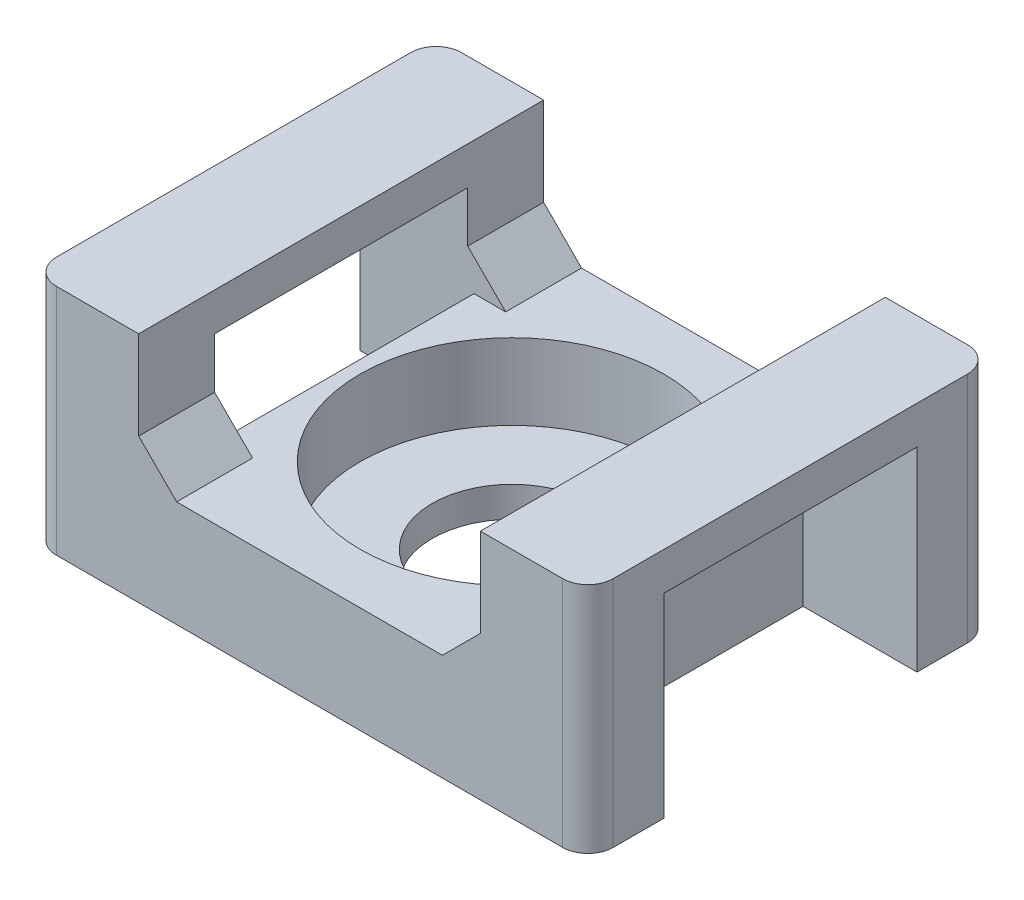
ISO-10303-21;
HEADER;
FILE_DESCRIPTION(('STEP AP214'),'2;1');
FILE_NAME('part.step','',(''),(''),'','','');
FILE_SCHEMA(('AUTOMOTIVE_DESIGN { 1 0 10303 214 1 1 1 1 }'));
ENDSEC;
DATA;
#1=APPLICATION_CONTEXT('core data for automotive mechanical design processes');
#2=APPLICATION_PROTOCOL_DEFINITION('international standard','automotive_design',2000,#1);
#3=PRODUCT_CONTEXT('',#1,'mechanical');
#4=PRODUCT('Part','Part','',(#3));
#5=PRODUCT_RELATED_PRODUCT_CATEGORY('part','',(#4));
#6=PRODUCT_DEFINITION_FORMATION('','',#4);
#7=PRODUCT_DEFINITION_CONTEXT('part definition',#1,'design');
#8=PRODUCT_DEFINITION('design','',#6,#7);
#9=PRODUCT_DEFINITION_SHAPE('','',#8);
#10=(LENGTH_UNIT() NAMED_UNIT(*) SI_UNIT(.MILLI.,.METRE.));
#11=(NAMED_UNIT(*) PLANE_ANGLE_UNIT() SI_UNIT($,.RADIAN.));
#12=(NAMED_UNIT(*) SI_UNIT($,.STERADIAN.) SOLID_ANGLE_UNIT());
#13=UNCERTAINTY_MEASURE_WITH_UNIT(LENGTH_MEASURE(1.E-05),#10,'distance_accuracy_value','');
#14=(GEOMETRIC_REPRESENTATION_CONTEXT(3) GLOBAL_UNCERTAINTY_ASSIGNED_CONTEXT((#13)) GLOBAL_UNIT_ASSIGNED_CONTEXT((#10,
#11,#12)) REPRESENTATION_CONTEXT('',''));
#15=CARTESIAN_POINT('',(0.,0.,0.));
#16=DIRECTION('',(0.,0.,1.));
#17=DIRECTION('',(1.,0.,0.));
#18=AXIS2_PLACEMENT_3D('',#15,#16,#17);
#19=CARTESIAN_POINT('',(-5.25,4.2,8.));
#20=DIRECTION('',(0.,-1.,0.));
#21=DIRECTION('',(1.,0.,0.));
#22=AXIS2_PLACEMENT_3D('',#19,#20,#21);
#23=PLANE('',#22);
#24=DIRECTION('',(-1.,0.,0.));
#25=VECTOR('',#24,1.);
#26=CARTESIAN_POINT('',(-5.25,4.2,-8.));
#27=LINE('',#26,#25);
#28=CARTESIAN_POINT('',(5.25,4.2,-8.));
#29=VERTEX_POINT('',#28);
#30=CARTESIAN_POINT('',(-5.25,4.2,-8.));
#31=VERTEX_POINT('',#30);
#32=EDGE_CURVE('E336',#29,#31,#27,.T.);
#33=ORIENTED_EDGE('',*,*,#32,.T.);
#34=DIRECTION('',(0.,0.,-1.));
#35=VECTOR('',#34,1.);
#36=CARTESIAN_POINT('',(-5.25,4.2,8.));
#37=LINE('',#36,#35);
#38=CARTESIAN_POINT('',(-5.25,4.2,-5.));
#39=VERTEX_POINT('',#38);
#40=EDGE_CURVE('E353',#39,#31,#37,.T.);
#41=ORIENTED_EDGE('',*,*,#40,.F.);
#42=DIRECTION('',(1.,0.,0.));
#43=VECTOR('',#42,1.);
#44=CARTESIAN_POINT('',(-5.25,4.2,-5.));
#45=LINE('',#44,#43);
#46=CARTESIAN_POINT('',(-6.5,4.2,-5.));
#47=VERTEX_POINT('',#46);
#48=EDGE_CURVE('E265',#47,#39,#45,.T.);
#49=ORIENTED_EDGE('',*,*,#48,.F.);
#50=DIRECTION('',(0.,0.,1.));
#51=VECTOR('',#50,1.);
#52=CARTESIAN_POINT('',(-6.5,4.2,-5.));
#53=LINE('',#52,#51);
#54=CARTESIAN_POINT('',(-6.5,4.2,5.));
#55=VERTEX_POINT('',#54);
#56=EDGE_CURVE('E303',#47,#55,#53,.T.);
#57=ORIENTED_EDGE('',*,*,#56,.T.);
#58=DIRECTION('',(1.,0.,0.));
#59=VECTOR('',#58,1.);
#60=CARTESIAN_POINT('',(-5.25,4.2,5.));
#61=LINE('',#60,#59);
#62=CARTESIAN_POINT('',(-5.25,4.2,5.));
#63=VERTEX_POINT('',#62);
#64=EDGE_CURVE('E285',#55,#63,#61,.T.);
#65=ORIENTED_EDGE('',*,*,#64,.T.);
#66=CARTESIAN_POINT('',(-5.25,4.2,8.));
#67=VERTEX_POINT('',#66);
#68=EDGE_CURVE('E354',#67,#63,#37,.T.);
#69=ORIENTED_EDGE('',*,*,#68,.F.);
#70=DIRECTION('',(-1.,0.,0.));
#71=VECTOR('',#70,1.);
#72=CARTESIAN_POINT('',(-5.25,4.2,8.));
#73=LINE('',#72,#71);
#74=CARTESIAN_POINT('',(5.25,4.2,8.));
#75=VERTEX_POINT('',#74);
#76=EDGE_CURVE('E317',#75,#67,#73,.T.);
#77=ORIENTED_EDGE('',*,*,#76,.F.);
#78=DIRECTION('',(0.,0.,-1.));
#79=VECTOR('',#78,1.);
#80=CARTESIAN_POINT('',(5.25,4.2,8.));
#81=LINE('',#80,#79);
#82=CARTESIAN_POINT('',(5.25,4.2,5.));
#83=VERTEX_POINT('',#82);
#84=EDGE_CURVE('E358',#75,#83,#81,.T.);
#85=ORIENTED_EDGE('',*,*,#84,.T.);
#86=DIRECTION('',(-1.,0.,0.));
#87=VECTOR('',#86,1.);
#88=CARTESIAN_POINT('',(5.25,4.2,5.));
#89=LINE('',#88,#87);
#90=CARTESIAN_POINT('',(6.5,4.2,5.));
#91=VERTEX_POINT('',#90);
#92=EDGE_CURVE('E534',#91,#83,#89,.T.);
#93=ORIENTED_EDGE('',*,*,#92,.F.);
#94=DIRECTION('',(0.,0.,1.));
#95=VECTOR('',#94,1.);
#96=CARTESIAN_POINT('',(6.5,4.2,-5.));
#97=LINE('',#96,#95);
#98=CARTESIAN_POINT('',(6.5,4.2,-5.));
#99=VERTEX_POINT('',#98);
#100=EDGE_CURVE('E250',#99,#91,#97,.T.);
#101=ORIENTED_EDGE('',*,*,#100,.F.);
#102=DIRECTION('',(-1.,0.,0.));
#103=VECTOR('',#102,1.);
#104=CARTESIAN_POINT('',(5.25,4.2,-5.));
#105=LINE('',#104,#103);
#106=CARTESIAN_POINT('',(5.25,4.2,-5.));
#107=VERTEX_POINT('',#106);
#108=EDGE_CURVE('E550',#99,#107,#105,.T.);
#109=ORIENTED_EDGE('',*,*,#108,.T.);
#110=EDGE_CURVE('E357',#107,#29,#81,.T.);
#111=ORIENTED_EDGE('',*,*,#110,.T.);
#112=EDGE_LOOP('',(#33,#41,#49,#57,#65,#69,#77,#85,#93,#101,#109,#111));
#113=FACE_BOUND('',#112,.T.);
#114=CARTESIAN_POINT('',(0.,4.2,0.));
#115=DIRECTION('',(0.,1.,0.));
#116=DIRECTION('',(0.,0.,1.));
#117=AXIS2_PLACEMENT_3D('',#114,#115,#116);
#118=CIRCLE('',#117,6.);
#119=CARTESIAN_POINT('',(0.,4.2,6.));
#120=VERTEX_POINT('',#119);
#121=EDGE_CURVE('E564',#120,#120,#118,.T.);
#122=ORIENTED_EDGE('',*,*,#121,.F.);
#123=EDGE_LOOP('',(#122));
#124=FACE_BOUND('',#123,.T.);
#125=ADVANCED_FACE('F35',(#113,#124),#23,.F.);
#126=CARTESIAN_POINT('',(6.75,5.70000000000001,8.));
#127=DIRECTION('',(0.707106781186549,-0.707106781186546,0.));
#128=DIRECTION('',(0.707106781186546,0.707106781186549,0.));
#129=AXIS2_PLACEMENT_3D('',#126,#127,#128);
#130=PLANE('',#129);
#131=DIRECTION('',(0.707106781186546,0.707106781186549,0.));
#132=VECTOR('',#131,1.);
#133=CARTESIAN_POINT('',(6.75,5.70000000000001,5.));
#134=LINE('',#133,#132);
#135=CARTESIAN_POINT('',(6.75,5.70000000000001,5.));
#136=VERTEX_POINT('',#135);
#137=EDGE_CURVE('E440',#83,#136,#134,.T.);
#138=ORIENTED_EDGE('',*,*,#137,.F.);
#139=ORIENTED_EDGE('',*,*,#84,.F.);
#140=DIRECTION('',(-0.707106781186546,-0.707106781186549,0.));
#141=VECTOR('',#140,1.);
#142=CARTESIAN_POINT('',(6.75,5.70000000000001,8.));
#143=LINE('',#142,#141);
#144=CARTESIAN_POINT('',(6.75,5.70000000000001,8.));
#145=VERTEX_POINT('',#144);
#146=EDGE_CURVE('E315',#145,#75,#143,.T.);
#147=ORIENTED_EDGE('',*,*,#146,.F.);
#148=DIRECTION('',(0.,0.,-1.));
#149=VECTOR('',#148,1.);
#150=CARTESIAN_POINT('',(6.75,5.70000000000001,8.));
#151=LINE('',#150,#149);
#152=EDGE_CURVE('E362',#145,#136,#151,.T.);
#153=ORIENTED_EDGE('',*,*,#152,.T.);
#154=EDGE_LOOP('',(#138,#139,#147,#153));
#155=FACE_BOUND('',#154,.T.);
#156=ADVANCED_FACE('F439',(#155),#130,.F.);
#157=CARTESIAN_POINT('',(-6.75,5.70000000000001,8.));
#158=DIRECTION('',(-0.707106781186549,-0.707106781186546,0.));
#159=DIRECTION('',(0.707106781186546,-0.707106781186549,0.));
#160=AXIS2_PLACEMENT_3D('',#157,#158,#159);
#161=PLANE('',#160);
#162=DIRECTION('',(-0.707106781186546,0.707106781186549,0.));
#163=VECTOR('',#162,1.);
#164=CARTESIAN_POINT('',(-6.75,5.70000000000001,5.));
#165=LINE('',#164,#163);
#166=CARTESIAN_POINT('',(-6.75,5.70000000000001,5.));
#167=VERTEX_POINT('',#166);
#168=EDGE_CURVE('E288',#63,#167,#165,.T.);
#169=ORIENTED_EDGE('',*,*,#168,.T.);
#170=DIRECTION('',(0.,0.,-1.));
#171=VECTOR('',#170,1.);
#172=CARTESIAN_POINT('',(-6.75,5.70000000000001,8.));
#173=LINE('',#172,#171);
#174=CARTESIAN_POINT('',(-6.75,5.70000000000001,8.));
#175=VERTEX_POINT('',#174);
#176=EDGE_CURVE('E350',#175,#167,#173,.T.);
#177=ORIENTED_EDGE('',*,*,#176,.F.);
#178=DIRECTION('',(-0.707106781186546,0.707106781186549,0.));
#179=VECTOR('',#178,1.);
#180=CARTESIAN_POINT('',(-6.75,5.70000000000001,8.));
#181=LINE('',#180,#179);
#182=EDGE_CURVE('E319',#67,#175,#181,.T.);
#183=ORIENTED_EDGE('',*,*,#182,.F.);
#184=ORIENTED_EDGE('',*,*,#68,.T.);
#185=EDGE_LOOP('',(#169,#177,#183,#184));
#186=FACE_BOUND('',#185,.T.);
#187=ADVANCED_FACE('F448',(#186),#161,.F.);
#188=CARTESIAN_POINT('',(-11.,0.,8.));
#189=DIRECTION('',(1.,0.,0.));
#190=DIRECTION('',(0.,0.,-1.));
#191=AXIS2_PLACEMENT_3D('',#188,#189,#190);
#192=PLANE('',#191);
#193=DIRECTION('',(0.,0.,-1.));
#194=VECTOR('',#193,1.);
#195=CARTESIAN_POINT('',(-11.,9.2,8.));
#196=LINE('',#195,#194);
#197=CARTESIAN_POINT('',(-11.,9.2,7.));
#198=VERTEX_POINT('',#197);
#199=CARTESIAN_POINT('',(-11.,9.2,-7.));
#200=VERTEX_POINT('',#199);
#201=EDGE_CURVE('E325',#198,#200,#196,.T.);
#202=ORIENTED_EDGE('',*,*,#201,.T.);
#203=DIRECTION('',(0.,-1.,0.));
#204=VECTOR('',#203,1.);
#205=CARTESIAN_POINT('',(-11.,0.,-7.));
#206=LINE('',#205,#204);
#207=CARTESIAN_POINT('',(-11.,0.,-7.));
#208=VERTEX_POINT('',#207);
#209=EDGE_CURVE('E400',#200,#208,#206,.T.);
#210=ORIENTED_EDGE('',*,*,#209,.T.);
#211=DIRECTION('',(0.,0.,-1.));
#212=VECTOR('',#211,1.);
#213=CARTESIAN_POINT('',(-11.,0.,8.));
#214=LINE('',#213,#212);
#215=CARTESIAN_POINT('',(-11.,0.,-5.));
#216=VERTEX_POINT('',#215);
#217=EDGE_CURVE('E374',#216,#208,#214,.T.);
#218=ORIENTED_EDGE('',*,*,#217,.F.);
#219=DIRECTION('',(0.,-1.,0.));
#220=VECTOR('',#219,1.);
#221=CARTESIAN_POINT('',(-11.,0.,-5.));
#222=LINE('',#221,#220);
#223=CARTESIAN_POINT('',(-11.,7.7,-5.));
#224=VERTEX_POINT('',#223);
#225=EDGE_CURVE('E256',#224,#216,#222,.T.);
#226=ORIENTED_EDGE('',*,*,#225,.F.);
#227=DIRECTION('',(0.,0.,1.));
#228=VECTOR('',#227,1.);
#229=CARTESIAN_POINT('',(-11.,7.7,-5.));
#230=LINE('',#229,#228);
#231=CARTESIAN_POINT('',(-11.,7.7,5.));
#232=VERTEX_POINT('',#231);
#233=EDGE_CURVE('E296',#224,#232,#230,.T.);
#234=ORIENTED_EDGE('',*,*,#233,.T.);
#235=DIRECTION('',(0.,-1.,0.));
#236=VECTOR('',#235,1.);
#237=CARTESIAN_POINT('',(-11.,0.,5.));
#238=LINE('',#237,#236);
#239=CARTESIAN_POINT('',(-11.,0.,5.));
#240=VERTEX_POINT('',#239);
#241=EDGE_CURVE('E275',#232,#240,#238,.T.);
#242=ORIENTED_EDGE('',*,*,#241,.T.);
#243=CARTESIAN_POINT('',(-11.,0.,7.));
#244=VERTEX_POINT('',#243);
#245=EDGE_CURVE('E375',#244,#240,#214,.T.);
#246=ORIENTED_EDGE('',*,*,#245,.F.);
#247=DIRECTION('',(0.,-1.,0.));
#248=VECTOR('',#247,1.);
#249=CARTESIAN_POINT('',(-11.,0.,7.));
#250=LINE('',#249,#248);
#251=EDGE_CURVE('E398',#244,#198,#250,.F.);
#252=ORIENTED_EDGE('',*,*,#251,.T.);
#253=EDGE_LOOP('',(#202,#210,#218,#226,#234,#242,#246,#252));
#254=FACE_BOUND('',#253,.T.);
#255=ADVANCED_FACE('F487',(#254),#192,.F.);
#256=CARTESIAN_POINT('',(11.,0.,8.));
#257=DIRECTION('',(0.,1.,0.));
#258=DIRECTION('',(0.,0.,1.));
#259=AXIS2_PLACEMENT_3D('',#256,#257,#258);
#260=PLANE('',#259);
#261=CARTESIAN_POINT('',(0.,0.,0.));
#262=DIRECTION('',(0.,1.,0.));
#263=DIRECTION('',(0.,0.,1.));
#264=AXIS2_PLACEMENT_3D('',#261,#262,#263);
#265=CIRCLE('',#264,3.15);
#266=CARTESIAN_POINT('',(0.,0.,3.15));
#267=VERTEX_POINT('',#266);
#268=EDGE_CURVE('E529',#267,#267,#265,.T.);
#269=ORIENTED_EDGE('',*,*,#268,.T.);
#270=EDGE_LOOP('',(#269));
#271=FACE_BOUND('',#270,.T.);
#272=DIRECTION('',(1.,0.,0.));
#273=VECTOR('',#272,1.);
#274=CARTESIAN_POINT('',(11.,0.,-8.));
#275=LINE('',#274,#273);
#276=CARTESIAN_POINT('',(-10.,0.,-8.));
#277=VERTEX_POINT('',#276);
#278=CARTESIAN_POINT('',(10.,0.,-8.));
#279=VERTEX_POINT('',#278);
#280=EDGE_CURVE('E299',#277,#279,#275,.T.);
#281=ORIENTED_EDGE('',*,*,#280,.T.);
#282=CARTESIAN_POINT('',(10.,0.,-7.));
#283=DIRECTION('',(0.,1.,0.));
#284=DIRECTION('',(0.,0.,1.));
#285=AXIS2_PLACEMENT_3D('',#282,#283,#284);
#286=CIRCLE('',#285,1.);
#287=CARTESIAN_POINT('',(11.,0.,-7.));
#288=VERTEX_POINT('',#287);
#289=EDGE_CURVE('E396',#279,#288,#286,.F.);
#290=ORIENTED_EDGE('',*,*,#289,.T.);
#291=DIRECTION('',(0.,0.,-1.));
#292=VECTOR('',#291,1.);
#293=CARTESIAN_POINT('',(11.,0.,8.));
#294=LINE('',#293,#292);
#295=CARTESIAN_POINT('',(11.,0.,-5.));
#296=VERTEX_POINT('',#295);
#297=EDGE_CURVE('E371',#296,#288,#294,.T.);
#298=ORIENTED_EDGE('',*,*,#297,.F.);
#299=DIRECTION('',(-1.,0.,0.));
#300=VECTOR('',#299,1.);
#301=CARTESIAN_POINT('',(6.5,0.,-5.));
#302=LINE('',#301,#300);
#303=CARTESIAN_POINT('',(6.5,0.,-5.));
#304=VERTEX_POINT('',#303);
#305=EDGE_CURVE('E239',#296,#304,#302,.T.);
#306=ORIENTED_EDGE('',*,*,#305,.T.);
#307=DIRECTION('',(0.,0.,1.));
#308=VECTOR('',#307,1.);
#309=CARTESIAN_POINT('',(6.5,0.,-5.));
#310=LINE('',#309,#308);
#311=CARTESIAN_POINT('',(6.5,0.,5.));
#312=VERTEX_POINT('',#311);
#313=EDGE_CURVE('E279',#304,#312,#310,.T.);
#314=ORIENTED_EDGE('',*,*,#313,.T.);
#315=DIRECTION('',(-1.,0.,0.));
#316=VECTOR('',#315,1.);
#317=CARTESIAN_POINT('',(6.5,0.,5.));
#318=LINE('',#317,#316);
#319=CARTESIAN_POINT('',(11.,0.,5.));
#320=VERTEX_POINT('',#319);
#321=EDGE_CURVE('E243',#320,#312,#318,.T.);
#322=ORIENTED_EDGE('',*,*,#321,.F.);
#323=CARTESIAN_POINT('',(11.,0.,7.));
#324=VERTEX_POINT('',#323);
#325=EDGE_CURVE('E372',#324,#320,#294,.T.);
#326=ORIENTED_EDGE('',*,*,#325,.F.);
#327=CARTESIAN_POINT('',(10.,0.,7.));
#328=DIRECTION('',(0.,1.,0.));
#329=DIRECTION('',(0.,0.,1.));
#330=AXIS2_PLACEMENT_3D('',#327,#328,#329);
#331=CIRCLE('',#330,1.);
#332=CARTESIAN_POINT('',(10.,0.,8.));
#333=VERTEX_POINT('',#332);
#334=EDGE_CURVE('E392',#324,#333,#331,.F.);
#335=ORIENTED_EDGE('',*,*,#334,.T.);
#336=DIRECTION('',(1.,0.,0.));
#337=VECTOR('',#336,1.);
#338=CARTESIAN_POINT('',(11.,0.,8.));
#339=LINE('',#338,#337);
#340=CARTESIAN_POINT('',(-10.,0.,8.));
#341=VERTEX_POINT('',#340);
#342=EDGE_CURVE('E307',#341,#333,#339,.T.);
#343=ORIENTED_EDGE('',*,*,#342,.F.);
#344=CARTESIAN_POINT('',(-10.,0.,7.));
#345=DIRECTION('',(0.,1.,0.));
#346=DIRECTION('',(0.,0.,1.));
#347=AXIS2_PLACEMENT_3D('',#344,#345,#346);
#348=CIRCLE('',#347,1.);
#349=EDGE_CURVE('E390',#341,#244,#348,.F.);
#350=ORIENTED_EDGE('',*,*,#349,.T.);
#351=ORIENTED_EDGE('',*,*,#245,.T.);
#352=DIRECTION('',(1.,0.,0.));
#353=VECTOR('',#352,1.);
#354=CARTESIAN_POINT('',(-6.5,0.,5.));
#355=LINE('',#354,#353);
#356=CARTESIAN_POINT('',(-6.5,0.,5.));
#357=VERTEX_POINT('',#356);
#358=EDGE_CURVE('E278',#240,#357,#355,.T.);
#359=ORIENTED_EDGE('',*,*,#358,.T.);
#360=DIRECTION('',(0.,0.,1.));
#361=VECTOR('',#360,1.);
#362=CARTESIAN_POINT('',(-6.5,0.,-5.));
#363=LINE('',#362,#361);
#364=CARTESIAN_POINT('',(-6.5,0.,-5.));
#365=VERTEX_POINT('',#364);
#366=EDGE_CURVE('E274',#365,#357,#363,.T.);
#367=ORIENTED_EDGE('',*,*,#366,.F.);
#368=DIRECTION('',(1.,0.,0.));
#369=VECTOR('',#368,1.);
#370=CARTESIAN_POINT('',(-6.5,0.,-5.));
#371=LINE('',#370,#369);
#372=EDGE_CURVE('E258',#216,#365,#371,.T.);
#373=ORIENTED_EDGE('',*,*,#372,.F.);
#374=ORIENTED_EDGE('',*,*,#217,.T.);
#375=CARTESIAN_POINT('',(-10.,0.,-7.));
#376=DIRECTION('',(0.,1.,0.));
#377=DIRECTION('',(0.,0.,1.));
#378=AXIS2_PLACEMENT_3D('',#375,#376,#377);
#379=CIRCLE('',#378,1.);
#380=EDGE_CURVE('E394',#208,#277,#379,.F.);
#381=ORIENTED_EDGE('',*,*,#380,.T.);
#382=EDGE_LOOP('',(#281,#290,#298,#306,#314,#322,#326,#335,#343,#350,#351,#359,#367,#373,#374,#381));
#383=FACE_BOUND('',#382,.T.);
#384=ADVANCED_FACE('F412',(#271,#383),#260,.F.);
#385=CARTESIAN_POINT('',(11.,0.,8.));
#386=DIRECTION('',(-1.,0.,0.));
#387=DIRECTION('',(0.,0.,1.));
#388=AXIS2_PLACEMENT_3D('',#385,#386,#387);
#389=PLANE('',#388);
#390=ORIENTED_EDGE('',*,*,#297,.T.);
#391=DIRECTION('',(0.,1.,0.));
#392=VECTOR('',#391,1.);
#393=CARTESIAN_POINT('',(11.,9.2,-7.));
#394=LINE('',#393,#392);
#395=CARTESIAN_POINT('',(11.,9.2,-7.));
#396=VERTEX_POINT('',#395);
#397=EDGE_CURVE('E379',#288,#396,#394,.T.);
#398=ORIENTED_EDGE('',*,*,#397,.T.);
#399=DIRECTION('',(0.,0.,-1.));
#400=VECTOR('',#399,1.);
#401=CARTESIAN_POINT('',(11.,9.2,8.));
#402=LINE('',#401,#400);
#403=CARTESIAN_POINT('',(11.,9.2,7.));
#404=VERTEX_POINT('',#403);
#405=EDGE_CURVE('E368',#404,#396,#402,.T.);
#406=ORIENTED_EDGE('',*,*,#405,.F.);
#407=DIRECTION('',(0.,1.,0.));
#408=VECTOR('',#407,1.);
#409=CARTESIAN_POINT('',(11.,0.,7.));
#410=LINE('',#409,#408);
#411=EDGE_CURVE('E377',#404,#324,#410,.F.);
#412=ORIENTED_EDGE('',*,*,#411,.T.);
#413=ORIENTED_EDGE('',*,*,#325,.T.);
#414=DIRECTION('',(0.,-1.,0.));
#415=VECTOR('',#414,1.);
#416=CARTESIAN_POINT('',(11.,0.,5.));
#417=LINE('',#416,#415);
#418=CARTESIAN_POINT('',(11.,7.7,5.));
#419=VERTEX_POINT('',#418);
#420=EDGE_CURVE('E248',#419,#320,#417,.T.);
#421=ORIENTED_EDGE('',*,*,#420,.F.);
#422=DIRECTION('',(0.,0.,1.));
#423=VECTOR('',#422,1.);
#424=CARTESIAN_POINT('',(11.,7.7,-5.));
#425=LINE('',#424,#423);
#426=CARTESIAN_POINT('',(11.,7.7,-5.));
#427=VERTEX_POINT('',#426);
#428=EDGE_CURVE('E226',#427,#419,#425,.T.);
#429=ORIENTED_EDGE('',*,*,#428,.F.);
#430=DIRECTION('',(0.,-1.,0.));
#431=VECTOR('',#430,1.);
#432=CARTESIAN_POINT('',(11.,0.,-5.));
#433=LINE('',#432,#431);
#434=EDGE_CURVE('E233',#427,#296,#433,.T.);
#435=ORIENTED_EDGE('',*,*,#434,.T.);
#436=EDGE_LOOP('',(#390,#398,#406,#412,#413,#421,#429,#435));
#437=FACE_BOUND('',#436,.T.);
#438=ADVANCED_FACE('F246',(#437),#389,.F.);
#439=CARTESIAN_POINT('',(11.,9.2,8.));
#440=DIRECTION('',(0.,-1.,0.));
#441=DIRECTION('',(1.,0.,0.));
#442=AXIS2_PLACEMENT_3D('',#439,#440,#441);
#443=PLANE('',#442);
#444=ORIENTED_EDGE('',*,*,#405,.T.);
#445=CARTESIAN_POINT('',(10.,9.2,-7.));
#446=DIRECTION('',(0.,-1.,0.));
#447=DIRECTION('',(1.,0.,0.));
#448=AXIS2_PLACEMENT_3D('',#445,#446,#447);
#449=CIRCLE('',#448,1.);
#450=CARTESIAN_POINT('',(10.,9.2,-8.));
#451=VERTEX_POINT('',#450);
#452=EDGE_CURVE('E384',#396,#451,#449,.F.);
#453=ORIENTED_EDGE('',*,*,#452,.T.);
#454=DIRECTION('',(-1.,0.,0.));
#455=VECTOR('',#454,1.);
#456=CARTESIAN_POINT('',(11.,9.2,-8.));
#457=LINE('',#456,#455);
#458=CARTESIAN_POINT('',(6.75,9.2,-8.));
#459=VERTEX_POINT('',#458);
#460=EDGE_CURVE('E328',#451,#459,#457,.T.);
#461=ORIENTED_EDGE('',*,*,#460,.T.);
#462=DIRECTION('',(0.,0.,-1.));
#463=VECTOR('',#462,1.);
#464=CARTESIAN_POINT('',(6.75,9.2,8.));
#465=LINE('',#464,#463);
#466=CARTESIAN_POINT('',(6.75,9.2,8.));
#467=VERTEX_POINT('',#466);
#468=EDGE_CURVE('E365',#467,#459,#465,.T.);
#469=ORIENTED_EDGE('',*,*,#468,.F.);
#470=DIRECTION('',(-1.,0.,0.));
#471=VECTOR('',#470,1.);
#472=CARTESIAN_POINT('',(11.,9.2,8.));
#473=LINE('',#472,#471);
#474=CARTESIAN_POINT('',(10.,9.2,8.));
#475=VERTEX_POINT('',#474);
#476=EDGE_CURVE('E310',#475,#467,#473,.T.);
#477=ORIENTED_EDGE('',*,*,#476,.F.);
#478=CARTESIAN_POINT('',(10.,9.2,7.));
#479=DIRECTION('',(0.,-1.,0.));
#480=DIRECTION('',(1.,0.,0.));
#481=AXIS2_PLACEMENT_3D('',#478,#479,#480);
#482=CIRCLE('',#481,1.);
#483=EDGE_CURVE('E382',#475,#404,#482,.F.);
#484=ORIENTED_EDGE('',*,*,#483,.T.);
#485=EDGE_LOOP('',(#444,#453,#461,#469,#477,#484));
#486=FACE_BOUND('',#485,.T.);
#487=ADVANCED_FACE('F423',(#486),#443,.F.);
#488=CARTESIAN_POINT('',(6.75,9.2,8.));
#489=DIRECTION('',(1.,0.,0.));
#490=DIRECTION('',(0.,1.,0.));
#491=AXIS2_PLACEMENT_3D('',#488,#489,#490);
#492=PLANE('',#491);
#493=CARTESIAN_POINT('',(6.75,5.70000000000001,-5.));
#494=VERTEX_POINT('',#493);
#495=CARTESIAN_POINT('',(6.75,5.70000000000001,-8.));
#496=VERTEX_POINT('',#495);
#497=EDGE_CURVE('E361',#494,#496,#151,.T.);
#498=ORIENTED_EDGE('',*,*,#497,.F.);
#499=DIRECTION('',(0.,1.,0.));
#500=VECTOR('',#499,1.);
#501=CARTESIAN_POINT('',(6.75,7.7,-5.));
#502=LINE('',#501,#500);
#503=CARTESIAN_POINT('',(6.75,7.7,-5.));
#504=VERTEX_POINT('',#503);
#505=EDGE_CURVE('E232',#494,#504,#502,.T.);
#506=ORIENTED_EDGE('',*,*,#505,.T.);
#507=DIRECTION('',(0.,0.,1.));
#508=VECTOR('',#507,1.);
#509=CARTESIAN_POINT('',(6.75,7.7,-5.));
#510=LINE('',#509,#508);
#511=CARTESIAN_POINT('',(6.75,7.7,5.));
#512=VERTEX_POINT('',#511);
#513=EDGE_CURVE('E229',#504,#512,#510,.T.);
#514=ORIENTED_EDGE('',*,*,#513,.T.);
#515=DIRECTION('',(0.,1.,0.));
#516=VECTOR('',#515,1.);
#517=CARTESIAN_POINT('',(6.75,7.7,5.));
#518=LINE('',#517,#516);
#519=EDGE_CURVE('E544',#136,#512,#518,.T.);
#520=ORIENTED_EDGE('',*,*,#519,.F.);
#521=ORIENTED_EDGE('',*,*,#152,.F.);
#522=DIRECTION('',(0.,-1.,0.));
#523=VECTOR('',#522,1.);
#524=CARTESIAN_POINT('',(6.75,9.2,8.));
#525=LINE('',#524,#523);
#526=EDGE_CURVE('E313',#467,#145,#525,.T.);
#527=ORIENTED_EDGE('',*,*,#526,.F.);
#528=ORIENTED_EDGE('',*,*,#468,.T.);
#529=DIRECTION('',(0.,-1.,0.));
#530=VECTOR('',#529,1.);
#531=CARTESIAN_POINT('',(6.75,9.2,-8.));
#532=LINE('',#531,#530);
#533=EDGE_CURVE('E330',#459,#496,#532,.T.);
#534=ORIENTED_EDGE('',*,*,#533,.T.);
#535=EDGE_LOOP('',(#498,#506,#514,#520,#521,#527,#528,#534));
#536=FACE_BOUND('',#535,.T.);
#537=ADVANCED_FACE('F431',(#536),#492,.F.);
#538=ORIENTED_EDGE('',*,*,#110,.F.);
#539=DIRECTION('',(0.707106781186546,0.707106781186549,0.));
#540=VECTOR('',#539,1.);
#541=CARTESIAN_POINT('',(6.75,5.70000000000001,-5.));
#542=LINE('',#541,#540);
#543=EDGE_CURVE('E552',#107,#494,#542,.T.);
#544=ORIENTED_EDGE('',*,*,#543,.T.);
#545=ORIENTED_EDGE('',*,*,#497,.T.);
#546=DIRECTION('',(-0.707106781186546,-0.707106781186549,0.));
#547=VECTOR('',#546,1.);
#548=CARTESIAN_POINT('',(6.75,5.70000000000001,-8.));
#549=LINE('',#548,#547);
#550=EDGE_CURVE('E333',#496,#29,#549,.T.);
#551=ORIENTED_EDGE('',*,*,#550,.T.);
#552=EDGE_LOOP('',(#538,#544,#545,#551));
#553=FACE_BOUND('',#552,.T.);
#554=ADVANCED_FACE('F474',(#553),#130,.F.);
#555=CARTESIAN_POINT('',(-6.75,5.70000000000001,-5.));
#556=VERTEX_POINT('',#555);
#557=CARTESIAN_POINT('',(-6.75,5.70000000000001,-8.));
#558=VERTEX_POINT('',#557);
#559=EDGE_CURVE('E349',#556,#558,#173,.T.);
#560=ORIENTED_EDGE('',*,*,#559,.F.);
#561=DIRECTION('',(-0.707106781186546,0.707106781186549,0.));
#562=VECTOR('',#561,1.);
#563=CARTESIAN_POINT('',(-6.75,5.70000000000001,-5.));
#564=LINE('',#563,#562);
#565=EDGE_CURVE('E267',#39,#556,#564,.T.);
#566=ORIENTED_EDGE('',*,*,#565,.F.);
#567=ORIENTED_EDGE('',*,*,#40,.T.);
#568=DIRECTION('',(-0.707106781186546,0.707106781186549,0.));
#569=VECTOR('',#568,1.);
#570=CARTESIAN_POINT('',(-6.75,5.70000000000001,-8.));
#571=LINE('',#570,#569);
#572=EDGE_CURVE('E339',#31,#558,#571,.T.);
#573=ORIENTED_EDGE('',*,*,#572,.T.);
#574=EDGE_LOOP('',(#560,#566,#567,#573));
#575=FACE_BOUND('',#574,.T.);
#576=ADVANCED_FACE('F465',(#575),#161,.F.);
#577=CARTESIAN_POINT('',(-6.75,9.2,8.));
#578=DIRECTION('',(-1.,0.,0.));
#579=DIRECTION('',(0.,0.,1.));
#580=AXIS2_PLACEMENT_3D('',#577,#578,#579);
#581=PLANE('',#580);
#582=DIRECTION('',(0.,0.,1.));
#583=VECTOR('',#582,1.);
#584=CARTESIAN_POINT('',(-6.75,7.7,-5.));
#585=LINE('',#584,#583);
#586=CARTESIAN_POINT('',(-6.75,7.7,-5.));
#587=VERTEX_POINT('',#586);
#588=CARTESIAN_POINT('',(-6.75,7.7,5.));
#589=VERTEX_POINT('',#588);
#590=EDGE_CURVE('E300',#587,#589,#585,.T.);
#591=ORIENTED_EDGE('',*,*,#590,.F.);
#592=DIRECTION('',(0.,1.,0.));
#593=VECTOR('',#592,1.);
#594=CARTESIAN_POINT('',(-6.75,7.7,-5.));
#595=LINE('',#594,#593);
#596=EDGE_CURVE('E269',#556,#587,#595,.T.);
#597=ORIENTED_EDGE('',*,*,#596,.F.);
#598=ORIENTED_EDGE('',*,*,#559,.T.);
#599=DIRECTION('',(0.,1.,0.));
#600=VECTOR('',#599,1.);
#601=CARTESIAN_POINT('',(-6.75,9.2,-8.));
#602=LINE('',#601,#600);
#603=CARTESIAN_POINT('',(-6.75,9.2,-8.));
#604=VERTEX_POINT('',#603);
#605=EDGE_CURVE('E342',#558,#604,#602,.T.);
#606=ORIENTED_EDGE('',*,*,#605,.T.);
#607=DIRECTION('',(0.,0.,-1.));
#608=VECTOR('',#607,1.);
#609=CARTESIAN_POINT('',(-6.75,9.2,8.));
#610=LINE('',#609,#608);
#611=CARTESIAN_POINT('',(-6.75,9.2,8.));
#612=VERTEX_POINT('',#611);
#613=EDGE_CURVE('E346',#612,#604,#610,.T.);
#614=ORIENTED_EDGE('',*,*,#613,.F.);
#615=DIRECTION('',(0.,1.,0.));
#616=VECTOR('',#615,1.);
#617=CARTESIAN_POINT('',(-6.75,9.2,8.));
#618=LINE('',#617,#616);
#619=EDGE_CURVE('E321',#175,#612,#618,.T.);
#620=ORIENTED_EDGE('',*,*,#619,.F.);
#621=ORIENTED_EDGE('',*,*,#176,.T.);
#622=DIRECTION('',(0.,1.,0.));
#623=VECTOR('',#622,1.);
#624=CARTESIAN_POINT('',(-6.75,7.7,5.));
#625=LINE('',#624,#623);
#626=EDGE_CURVE('E291',#167,#589,#625,.T.);
#627=ORIENTED_EDGE('',*,*,#626,.T.);
#628=EDGE_LOOP('',(#591,#597,#598,#606,#614,#620,#621,#627));
#629=FACE_BOUND('',#628,.T.);
#630=ADVANCED_FACE('F453',(#629),#581,.F.);
#631=CARTESIAN_POINT('',(-11.,9.2,8.));
#632=DIRECTION('',(0.,-1.,0.));
#633=DIRECTION('',(0.,0.,-1.));
#634=AXIS2_PLACEMENT_3D('',#631,#632,#633);
#635=PLANE('',#634);
#636=DIRECTION('',(-1.,0.,0.));
#637=VECTOR('',#636,1.);
#638=CARTESIAN_POINT('',(-11.,9.2,-8.));
#639=LINE('',#638,#637);
#640=CARTESIAN_POINT('',(-10.,9.2,-8.));
#641=VERTEX_POINT('',#640);
#642=EDGE_CURVE('E311',#604,#641,#639,.T.);
#643=ORIENTED_EDGE('',*,*,#642,.T.);
#644=CARTESIAN_POINT('',(-10.,9.2,-7.));
#645=DIRECTION('',(0.,-1.,0.));
#646=DIRECTION('',(0.,0.,-1.));
#647=AXIS2_PLACEMENT_3D('',#644,#645,#646);
#648=CIRCLE('',#647,1.);
#649=EDGE_CURVE('E56',#641,#200,#648,.F.);
#650=ORIENTED_EDGE('',*,*,#649,.T.);
#651=ORIENTED_EDGE('',*,*,#201,.F.);
#652=CARTESIAN_POINT('',(-10.,9.2,7.));
#653=DIRECTION('',(0.,-1.,0.));
#654=DIRECTION('',(0.,0.,-1.));
#655=AXIS2_PLACEMENT_3D('',#652,#653,#654);
#656=CIRCLE('',#655,1.);
#657=CARTESIAN_POINT('',(-10.,9.2,8.));
#658=VERTEX_POINT('',#657);
#659=EDGE_CURVE('E50',#198,#658,#656,.F.);
#660=ORIENTED_EDGE('',*,*,#659,.T.);
#661=DIRECTION('',(-1.,0.,0.));
#662=VECTOR('',#661,1.);
#663=CARTESIAN_POINT('',(-11.,9.2,8.));
#664=LINE('',#663,#662);
#665=EDGE_CURVE('E323',#612,#658,#664,.T.);
#666=ORIENTED_EDGE('',*,*,#665,.F.);
#667=ORIENTED_EDGE('',*,*,#613,.T.);
#668=EDGE_LOOP('',(#643,#650,#651,#660,#666,#667));
#669=FACE_BOUND('',#668,.T.);
#670=ADVANCED_FACE('F456',(#669),#635,.F.);
#671=CARTESIAN_POINT('',(0.,0.,8.));
#672=DIRECTION('',(0.,0.,-1.));
#673=DIRECTION('',(-1.,0.,0.));
#674=AXIS2_PLACEMENT_3D('',#671,#672,#673);
#675=PLANE('',#674);
#676=ORIENTED_EDGE('',*,*,#342,.T.);
#677=DIRECTION('',(0.,1.,0.));
#678=VECTOR('',#677,1.);
#679=CARTESIAN_POINT('',(10.,0.,8.));
#680=LINE('',#679,#678);
#681=EDGE_CURVE('E11',#333,#475,#680,.T.);
#682=ORIENTED_EDGE('',*,*,#681,.T.);
#683=ORIENTED_EDGE('',*,*,#476,.T.);
#684=ORIENTED_EDGE('',*,*,#526,.T.);
#685=ORIENTED_EDGE('',*,*,#146,.T.);
#686=ORIENTED_EDGE('',*,*,#76,.T.);
#687=ORIENTED_EDGE('',*,*,#182,.T.);
#688=ORIENTED_EDGE('',*,*,#619,.T.);
#689=ORIENTED_EDGE('',*,*,#665,.T.);
#690=DIRECTION('',(0.,-1.,0.));
#691=VECTOR('',#690,1.);
#692=CARTESIAN_POINT('',(-10.,0.,8.));
#693=LINE('',#692,#691);
#694=EDGE_CURVE('E43',#658,#341,#693,.T.);
#695=ORIENTED_EDGE('',*,*,#694,.T.);
#696=EDGE_LOOP('',(#676,#682,#683,#684,#685,#686,#687,#688,#689,#695));
#697=FACE_BOUND('',#696,.T.);
#698=ADVANCED_FACE('F408',(#697),#675,.F.);
#699=CARTESIAN_POINT('',(0.,0.,-8.));
#700=DIRECTION('',(0.,0.,-1.));
#701=DIRECTION('',(-1.,0.,0.));
#702=AXIS2_PLACEMENT_3D('',#699,#700,#701);
#703=PLANE('',#702);
#704=ORIENTED_EDGE('',*,*,#460,.F.);
#705=DIRECTION('',(0.,1.,0.));
#706=VECTOR('',#705,1.);
#707=CARTESIAN_POINT('',(10.,0.,-8.));
#708=LINE('',#707,#706);
#709=EDGE_CURVE('E388',#451,#279,#708,.F.);
#710=ORIENTED_EDGE('',*,*,#709,.T.);
#711=ORIENTED_EDGE('',*,*,#280,.F.);
#712=DIRECTION('',(0.,-1.,0.));
#713=VECTOR('',#712,1.);
#714=CARTESIAN_POINT('',(-10.,9.2,-8.));
#715=LINE('',#714,#713);
#716=EDGE_CURVE('E386',#277,#641,#715,.F.);
#717=ORIENTED_EDGE('',*,*,#716,.T.);
#718=ORIENTED_EDGE('',*,*,#642,.F.);
#719=ORIENTED_EDGE('',*,*,#605,.F.);
#720=ORIENTED_EDGE('',*,*,#572,.F.);
#721=ORIENTED_EDGE('',*,*,#32,.F.);
#722=ORIENTED_EDGE('',*,*,#550,.F.);
#723=ORIENTED_EDGE('',*,*,#533,.F.);
#724=EDGE_LOOP('',(#704,#710,#711,#717,#718,#719,#720,#721,#722,#723));
#725=FACE_BOUND('',#724,.T.);
#726=ADVANCED_FACE('F463',(#725),#703,.T.);
#727=CARTESIAN_POINT('',(-11.,7.7,-5.));
#728=DIRECTION('',(0.,1.,0.));
#729=DIRECTION('',(0.,0.,1.));
#730=AXIS2_PLACEMENT_3D('',#727,#728,#729);
#731=PLANE('',#730);
#732=DIRECTION('',(-1.,0.,0.));
#733=VECTOR('',#732,1.);
#734=CARTESIAN_POINT('',(-11.,7.7,5.));
#735=LINE('',#734,#733);
#736=EDGE_CURVE('E259',#589,#232,#735,.T.);
#737=ORIENTED_EDGE('',*,*,#736,.T.);
#738=ORIENTED_EDGE('',*,*,#233,.F.);
#739=DIRECTION('',(-1.,0.,0.));
#740=VECTOR('',#739,1.);
#741=CARTESIAN_POINT('',(-11.,7.7,-5.));
#742=LINE('',#741,#740);
#743=EDGE_CURVE('E271',#587,#224,#742,.T.);
#744=ORIENTED_EDGE('',*,*,#743,.F.);
#745=ORIENTED_EDGE('',*,*,#590,.T.);
#746=EDGE_LOOP('',(#737,#738,#744,#745));
#747=FACE_BOUND('',#746,.T.);
#748=ADVANCED_FACE('F596',(#747),#731,.F.);
#749=CARTESIAN_POINT('',(-6.5,4.2,-5.));
#750=DIRECTION('',(1.,0.,0.));
#751=DIRECTION('',(0.,1.,0.));
#752=AXIS2_PLACEMENT_3D('',#749,#750,#751);
#753=PLANE('',#752);
#754=DIRECTION('',(0.,1.,0.));
#755=VECTOR('',#754,1.);
#756=CARTESIAN_POINT('',(-6.5,4.2,5.));
#757=LINE('',#756,#755);
#758=EDGE_CURVE('E282',#357,#55,#757,.T.);
#759=ORIENTED_EDGE('',*,*,#758,.T.);
#760=ORIENTED_EDGE('',*,*,#56,.F.);
#761=DIRECTION('',(0.,1.,0.));
#762=VECTOR('',#761,1.);
#763=CARTESIAN_POINT('',(-6.5,4.2,-5.));
#764=LINE('',#763,#762);
#765=EDGE_CURVE('E262',#365,#47,#764,.T.);
#766=ORIENTED_EDGE('',*,*,#765,.F.);
#767=ORIENTED_EDGE('',*,*,#366,.T.);
#768=EDGE_LOOP('',(#759,#760,#766,#767));
#769=FACE_BOUND('',#768,.T.);
#770=ADVANCED_FACE('F513',(#769),#753,.F.);
#771=CARTESIAN_POINT('',(0.,0.,-5.));
#772=DIRECTION('',(0.,0.,-1.));
#773=DIRECTION('',(-1.,0.,0.));
#774=AXIS2_PLACEMENT_3D('',#771,#772,#773);
#775=PLANE('',#774);
#776=ORIENTED_EDGE('',*,*,#225,.T.);
#777=ORIENTED_EDGE('',*,*,#372,.T.);
#778=ORIENTED_EDGE('',*,*,#765,.T.);
#779=ORIENTED_EDGE('',*,*,#48,.T.);
#780=ORIENTED_EDGE('',*,*,#565,.T.);
#781=ORIENTED_EDGE('',*,*,#596,.T.);
#782=ORIENTED_EDGE('',*,*,#743,.T.);
#783=EDGE_LOOP('',(#776,#777,#778,#779,#780,#781,#782));
#784=FACE_BOUND('',#783,.T.);
#785=ADVANCED_FACE('F591',(#784),#775,.F.);
#786=CARTESIAN_POINT('',(0.,0.,5.));
#787=DIRECTION('',(0.,0.,-1.));
#788=DIRECTION('',(-1.,0.,0.));
#789=AXIS2_PLACEMENT_3D('',#786,#787,#788);
#790=PLANE('',#789);
#791=ORIENTED_EDGE('',*,*,#241,.F.);
#792=ORIENTED_EDGE('',*,*,#736,.F.);
#793=ORIENTED_EDGE('',*,*,#626,.F.);
#794=ORIENTED_EDGE('',*,*,#168,.F.);
#795=ORIENTED_EDGE('',*,*,#64,.F.);
#796=ORIENTED_EDGE('',*,*,#758,.F.);
#797=ORIENTED_EDGE('',*,*,#358,.F.);
#798=EDGE_LOOP('',(#791,#792,#793,#794,#795,#796,#797));
#799=FACE_BOUND('',#798,.T.);
#800=ADVANCED_FACE('F511',(#799),#790,.T.);
#801=CARTESIAN_POINT('',(6.5,4.2,-5.));
#802=DIRECTION('',(1.,0.,0.));
#803=DIRECTION('',(0.,1.,0.));
#804=AXIS2_PLACEMENT_3D('',#801,#802,#803);
#805=PLANE('',#804);
#806=DIRECTION('',(0.,1.,0.));
#807=VECTOR('',#806,1.);
#808=CARTESIAN_POINT('',(6.5,4.2,5.));
#809=LINE('',#808,#807);
#810=EDGE_CURVE('E532',#312,#91,#809,.T.);
#811=ORIENTED_EDGE('',*,*,#810,.F.);
#812=ORIENTED_EDGE('',*,*,#313,.F.);
#813=DIRECTION('',(0.,1.,0.));
#814=VECTOR('',#813,1.);
#815=CARTESIAN_POINT('',(6.5,4.2,-5.));
#816=LINE('',#815,#814);
#817=EDGE_CURVE('E252',#304,#99,#816,.T.);
#818=ORIENTED_EDGE('',*,*,#817,.T.);
#819=ORIENTED_EDGE('',*,*,#100,.T.);
#820=EDGE_LOOP('',(#811,#812,#818,#819));
#821=FACE_BOUND('',#820,.T.);
#822=ADVANCED_FACE('F541',(#821),#805,.T.);
#823=CARTESIAN_POINT('',(11.,7.7,-5.));
#824=DIRECTION('',(0.,-1.,0.));
#825=DIRECTION('',(0.,0.,-1.));
#826=AXIS2_PLACEMENT_3D('',#823,#824,#825);
#827=PLANE('',#826);
#828=DIRECTION('',(1.,0.,0.));
#829=VECTOR('',#828,1.);
#830=CARTESIAN_POINT('',(11.,7.7,5.));
#831=LINE('',#830,#829);
#832=EDGE_CURVE('E528',#512,#419,#831,.T.);
#833=ORIENTED_EDGE('',*,*,#832,.F.);
#834=ORIENTED_EDGE('',*,*,#513,.F.);
#835=DIRECTION('',(1.,0.,0.));
#836=VECTOR('',#835,1.);
#837=CARTESIAN_POINT('',(11.,7.7,-5.));
#838=LINE('',#837,#836);
#839=EDGE_CURVE('E221',#504,#427,#838,.T.);
#840=ORIENTED_EDGE('',*,*,#839,.T.);
#841=ORIENTED_EDGE('',*,*,#428,.T.);
#842=EDGE_LOOP('',(#833,#834,#840,#841));
#843=FACE_BOUND('',#842,.T.);
#844=ADVANCED_FACE('F224',(#843),#827,.T.);
#845=CARTESIAN_POINT('',(0.,0.,-5.));
#846=DIRECTION('',(0.,0.,-1.));
#847=DIRECTION('',(1.,0.,0.));
#848=AXIS2_PLACEMENT_3D('',#845,#846,#847);
#849=PLANE('',#848);
#850=ORIENTED_EDGE('',*,*,#434,.F.);
#851=ORIENTED_EDGE('',*,*,#839,.F.);
#852=ORIENTED_EDGE('',*,*,#505,.F.);
#853=ORIENTED_EDGE('',*,*,#543,.F.);
#854=ORIENTED_EDGE('',*,*,#108,.F.);
#855=ORIENTED_EDGE('',*,*,#817,.F.);
#856=ORIENTED_EDGE('',*,*,#305,.F.);
#857=EDGE_LOOP('',(#850,#851,#852,#853,#854,#855,#856));
#858=FACE_BOUND('',#857,.T.);
#859=ADVANCED_FACE('F236',(#858),#849,.F.);
#860=CARTESIAN_POINT('',(0.,0.,5.));
#861=DIRECTION('',(0.,0.,-1.));
#862=DIRECTION('',(1.,0.,0.));
#863=AXIS2_PLACEMENT_3D('',#860,#861,#862);
#864=PLANE('',#863);
#865=ORIENTED_EDGE('',*,*,#420,.T.);
#866=ORIENTED_EDGE('',*,*,#321,.T.);
#867=ORIENTED_EDGE('',*,*,#810,.T.);
#868=ORIENTED_EDGE('',*,*,#92,.T.);
#869=ORIENTED_EDGE('',*,*,#137,.T.);
#870=ORIENTED_EDGE('',*,*,#519,.T.);
#871=ORIENTED_EDGE('',*,*,#832,.T.);
#872=EDGE_LOOP('',(#865,#866,#867,#868,#869,#870,#871));
#873=FACE_BOUND('',#872,.T.);
#874=ADVANCED_FACE('F526',(#873),#864,.T.);
#875=CARTESIAN_POINT('',(0.,4.2,0.));
#876=DIRECTION('',(0.,1.,0.));
#877=DIRECTION('',(0.,0.,1.));
#878=AXIS2_PLACEMENT_3D('',#875,#876,#877);
#879=CYLINDRICAL_SURFACE('',#878,3.15);
#880=ORIENTED_EDGE('',*,*,#268,.F.);
#881=EDGE_LOOP('',(#880));
#882=FACE_BOUND('',#881,.T.);
#883=CARTESIAN_POINT('',(0.,1.2,0.));
#884=DIRECTION('',(0.,1.,0.));
#885=DIRECTION('',(0.,0.,1.));
#886=AXIS2_PLACEMENT_3D('',#883,#884,#885);
#887=CIRCLE('',#886,3.15);
#888=CARTESIAN_POINT('',(0.,1.2,3.15));
#889=VERTEX_POINT('',#888);
#890=EDGE_CURVE('E558',#889,#889,#887,.T.);
#891=ORIENTED_EDGE('',*,*,#890,.T.);
#892=EDGE_LOOP('',(#891));
#893=FACE_BOUND('',#892,.T.);
#894=ADVANCED_FACE('F575',(#882,#893),#879,.F.);
#895=CARTESIAN_POINT('',(3.15,1.2,0.));
#896=DIRECTION('',(0.,-1.,0.));
#897=DIRECTION('',(0.,0.,-1.));
#898=AXIS2_PLACEMENT_3D('',#895,#896,#897);
#899=PLANE('',#898);
#900=ORIENTED_EDGE('',*,*,#890,.F.);
#901=EDGE_LOOP('',(#900));
#902=FACE_BOUND('',#901,.T.);
#903=CARTESIAN_POINT('',(0.,1.2,0.));
#904=DIRECTION('',(0.,1.,0.));
#905=DIRECTION('',(0.,0.,1.));
#906=AXIS2_PLACEMENT_3D('',#903,#904,#905);
#907=CIRCLE('',#906,6.);
#908=CARTESIAN_POINT('',(0.,1.2,6.));
#909=VERTEX_POINT('',#908);
#910=EDGE_CURVE('E561',#909,#909,#907,.T.);
#911=ORIENTED_EDGE('',*,*,#910,.T.);
#912=EDGE_LOOP('',(#911));
#913=FACE_BOUND('',#912,.T.);
#914=ADVANCED_FACE('F569',(#902,#913),#899,.F.);
#915=CARTESIAN_POINT('',(0.,4.2,0.));
#916=DIRECTION('',(0.,1.,0.));
#917=DIRECTION('',(0.,0.,1.));
#918=AXIS2_PLACEMENT_3D('',#915,#916,#917);
#919=CYLINDRICAL_SURFACE('',#918,6.);
#920=ORIENTED_EDGE('',*,*,#910,.F.);
#921=EDGE_LOOP('',(#920));
#922=FACE_BOUND('',#921,.T.);
#923=ORIENTED_EDGE('',*,*,#121,.T.);
#924=EDGE_LOOP('',(#923));
#925=FACE_BOUND('',#924,.T.);
#926=ADVANCED_FACE('F496',(#922,#925),#919,.F.);
#927=CARTESIAN_POINT('',(10.,0.,-7.));
#928=DIRECTION('',(0.,-1.,0.));
#929=DIRECTION('',(0.,0.,-1.));
#930=AXIS2_PLACEMENT_3D('',#927,#928,#929);
#931=CYLINDRICAL_SURFACE('',#930,1.);
#932=ORIENTED_EDGE('',*,*,#289,.F.);
#933=ORIENTED_EDGE('',*,*,#709,.F.);
#934=ORIENTED_EDGE('',*,*,#452,.F.);
#935=ORIENTED_EDGE('',*,*,#397,.F.);
#936=EDGE_LOOP('',(#932,#933,#934,#935));
#937=FACE_BOUND('',#936,.T.);
#938=ADVANCED_FACE('F492',(#937),#931,.T.);
#939=CARTESIAN_POINT('',(-10.,0.,-7.));
#940=DIRECTION('',(0.,1.,0.));
#941=DIRECTION('',(0.,0.,1.));
#942=AXIS2_PLACEMENT_3D('',#939,#940,#941);
#943=CYLINDRICAL_SURFACE('',#942,1.);
#944=ORIENTED_EDGE('',*,*,#649,.F.);
#945=ORIENTED_EDGE('',*,*,#716,.F.);
#946=ORIENTED_EDGE('',*,*,#380,.F.);
#947=ORIENTED_EDGE('',*,*,#209,.F.);
#948=EDGE_LOOP('',(#944,#945,#946,#947));
#949=FACE_BOUND('',#948,.T.);
#950=ADVANCED_FACE('F495',(#949),#943,.T.);
#951=CARTESIAN_POINT('',(10.,0.,7.));
#952=DIRECTION('',(0.,1.,0.));
#953=DIRECTION('',(0.,0.,1.));
#954=AXIS2_PLACEMENT_3D('',#951,#952,#953);
#955=CYLINDRICAL_SURFACE('',#954,1.);
#956=ORIENTED_EDGE('',*,*,#334,.F.);
#957=ORIENTED_EDGE('',*,*,#411,.F.);
#958=ORIENTED_EDGE('',*,*,#483,.F.);
#959=ORIENTED_EDGE('',*,*,#681,.F.);
#960=EDGE_LOOP('',(#956,#957,#958,#959));
#961=FACE_BOUND('',#960,.T.);
#962=ADVANCED_FACE('F419',(#961),#955,.T.);
#963=CARTESIAN_POINT('',(-10.,0.,7.));
#964=DIRECTION('',(0.,-1.,0.));
#965=DIRECTION('',(0.,0.,-1.));
#966=AXIS2_PLACEMENT_3D('',#963,#964,#965);
#967=CYLINDRICAL_SURFACE('',#966,1.);
#968=ORIENTED_EDGE('',*,*,#659,.F.);
#969=ORIENTED_EDGE('',*,*,#251,.F.);
#970=ORIENTED_EDGE('',*,*,#349,.F.);
#971=ORIENTED_EDGE('',*,*,#694,.F.);
#972=EDGE_LOOP('',(#968,#969,#970,#971));
#973=FACE_BOUND('',#972,.T.);
#974=ADVANCED_FACE('F37',(#973),#967,.T.);
#975=CLOSED_SHELL('',(#125,#156,#187,#255,#384,#438,#487,#537,#554,#576,#630,#670,#698,#726,
#748,#770,#785,#800,#822,#844,#859,#874,#894,#914,#926,#938,#950,#962,#974));
#976=MANIFOLD_SOLID_BREP('B2',#975);
#977=ADVANCED_BREP_SHAPE_REPRESENTATION('',(#18,#976),#14);
#978=SHAPE_DEFINITION_REPRESENTATION(#9,#977);
ENDSEC;
END-ISO-10303-21;
